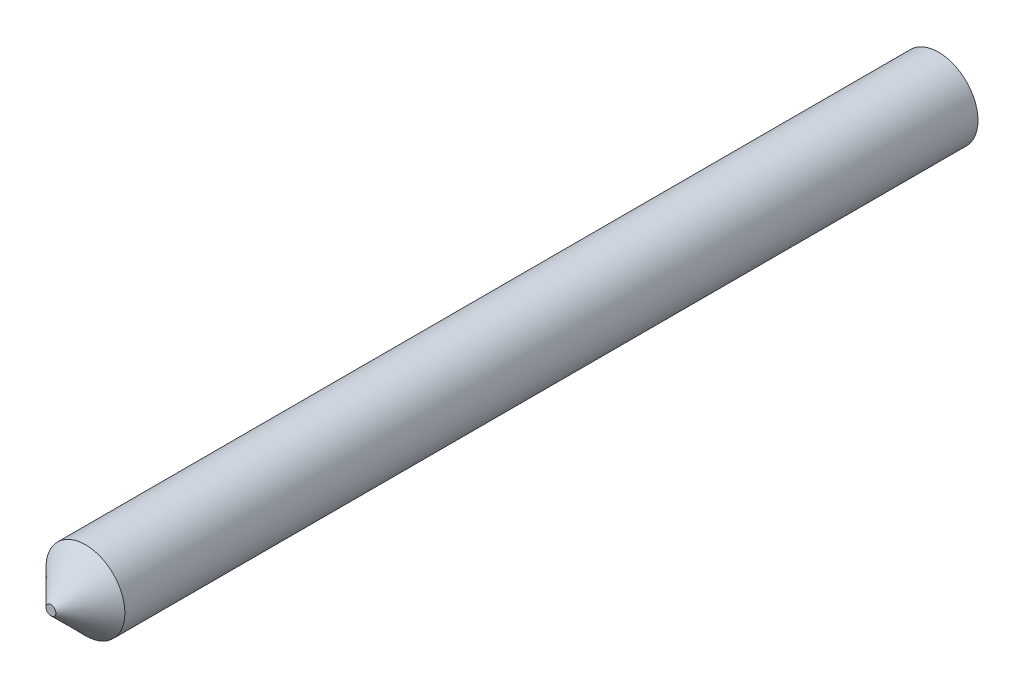
ISO-10303-21;
HEADER;
FILE_DESCRIPTION(('STEP AP214'),'2;1');
FILE_NAME('part.step','',(''),(''),'','','');
FILE_SCHEMA(('AUTOMOTIVE_DESIGN { 1 0 10303 214 1 1 1 1 }'));
ENDSEC;
DATA;
#1=APPLICATION_CONTEXT('core data for automotive mechanical design processes');
#2=APPLICATION_PROTOCOL_DEFINITION('international standard','automotive_design',2000,#1);
#3=PRODUCT_CONTEXT('',#1,'mechanical');
#4=PRODUCT('Part','Part','',(#3));
#5=PRODUCT_RELATED_PRODUCT_CATEGORY('part','',(#4));
#6=PRODUCT_DEFINITION_FORMATION('','',#4);
#7=PRODUCT_DEFINITION_CONTEXT('part definition',#1,'design');
#8=PRODUCT_DEFINITION('design','',#6,#7);
#9=PRODUCT_DEFINITION_SHAPE('','',#8);
#10=(LENGTH_UNIT() NAMED_UNIT(*) SI_UNIT(.MILLI.,.METRE.));
#11=(NAMED_UNIT(*) PLANE_ANGLE_UNIT() SI_UNIT($,.RADIAN.));
#12=(NAMED_UNIT(*) SI_UNIT($,.STERADIAN.) SOLID_ANGLE_UNIT());
#13=UNCERTAINTY_MEASURE_WITH_UNIT(LENGTH_MEASURE(1.E-05),#10,'distance_accuracy_value','');
#14=(GEOMETRIC_REPRESENTATION_CONTEXT(3) GLOBAL_UNCERTAINTY_ASSIGNED_CONTEXT((#13)) GLOBAL_UNIT_ASSIGNED_CONTEXT((#10,
#11,#12)) REPRESENTATION_CONTEXT('',''));
#15=CARTESIAN_POINT('',(0.,0.,0.));
#16=DIRECTION('',(0.,0.,1.));
#17=DIRECTION('',(1.,0.,0.));
#18=AXIS2_PLACEMENT_3D('',#15,#16,#17);
#19=CARTESIAN_POINT('',(0.,0.,45.));
#20=DIRECTION('',(0.,0.,-1.));
#21=DIRECTION('',(-1.,0.,0.));
#22=AXIS2_PLACEMENT_3D('',#19,#20,#21);
#23=CYLINDRICAL_SURFACE('',#22,2.);
#24=CARTESIAN_POINT('',(0.,0.,43.25));
#25=DIRECTION('',(0.,0.,1.));
#26=DIRECTION('',(1.,0.,0.));
#27=AXIS2_PLACEMENT_3D('',#24,#25,#26);
#28=CIRCLE('',#27,2.);
#29=CARTESIAN_POINT('',(2.,0.,43.25));
#30=VERTEX_POINT('',#29);
#31=EDGE_CURVE('E10',#30,#30,#28,.F.);
#32=ORIENTED_EDGE('',*,*,#31,.T.);
#33=EDGE_LOOP('',(#32));
#34=FACE_BOUND('',#33,.T.);
#35=CARTESIAN_POINT('',(0.,0.,0.));
#36=DIRECTION('',(0.,0.,1.));
#37=DIRECTION('',(1.,0.,0.));
#38=AXIS2_PLACEMENT_3D('',#35,#36,#37);
#39=CIRCLE('',#38,2.);
#40=CARTESIAN_POINT('',(2.,0.,0.));
#41=VERTEX_POINT('',#40);
#42=EDGE_CURVE('E41',#41,#41,#39,.T.);
#43=ORIENTED_EDGE('',*,*,#42,.T.);
#44=EDGE_LOOP('',(#43));
#45=FACE_BOUND('',#44,.T.);
#46=ADVANCED_FACE('F30',(#34,#45),#23,.T.);
#47=CARTESIAN_POINT('',(0.,0.,45.));
#48=DIRECTION('',(0.,0.,1.));
#49=DIRECTION('',(1.,0.,0.));
#50=AXIS2_PLACEMENT_3D('',#47,#48,#49);
#51=PLANE('',#50);
#52=CARTESIAN_POINT('',(0.,0.,45.));
#53=DIRECTION('',(0.,0.,1.));
#54=DIRECTION('',(1.,0.,0.));
#55=AXIS2_PLACEMENT_3D('',#52,#53,#54);
#56=CIRCLE('',#55,0.250000000000021);
#57=CARTESIAN_POINT('',(0.250000000000021,0.,45.));
#58=VERTEX_POINT('',#57);
#59=EDGE_CURVE('E37',#58,#58,#56,.T.);
#60=ORIENTED_EDGE('',*,*,#59,.T.);
#61=EDGE_LOOP('',(#60));
#62=FACE_BOUND('',#61,.T.);
#63=ADVANCED_FACE('F51',(#62),#51,.T.);
#64=CARTESIAN_POINT('',(0.,0.,0.));
#65=DIRECTION('',(0.,0.,1.));
#66=DIRECTION('',(1.,0.,0.));
#67=AXIS2_PLACEMENT_3D('',#64,#65,#66);
#68=PLANE('',#67);
#69=ORIENTED_EDGE('',*,*,#42,.F.);
#70=EDGE_LOOP('',(#69));
#71=FACE_BOUND('',#70,.T.);
#72=ADVANCED_FACE('F49',(#71),#68,.F.);
#73=CARTESIAN_POINT('',(0.,0.,45.));
#74=DIRECTION('',(0.,0.,-1.));
#75=DIRECTION('',(-1.,0.,0.));
#76=AXIS2_PLACEMENT_3D('',#73,#74,#75);
#77=CONICAL_SURFACE('',#76,0.250000000000021,0.785398163397446);
#78=ORIENTED_EDGE('',*,*,#31,.F.);
#79=EDGE_LOOP('',(#78));
#80=FACE_BOUND('',#79,.T.);
#81=ORIENTED_EDGE('',*,*,#59,.F.);
#82=EDGE_LOOP('',(#81));
#83=FACE_BOUND('',#82,.T.);
#84=ADVANCED_FACE('F32',(#80,#83),#77,.T.);
#85=CLOSED_SHELL('',(#46,#63,#72,#84));
#86=MANIFOLD_SOLID_BREP('B2',#85);
#87=ADVANCED_BREP_SHAPE_REPRESENTATION('',(#18,#86),#14);
#88=SHAPE_DEFINITION_REPRESENTATION(#9,#87);
ENDSEC;
END-ISO-10303-21;
